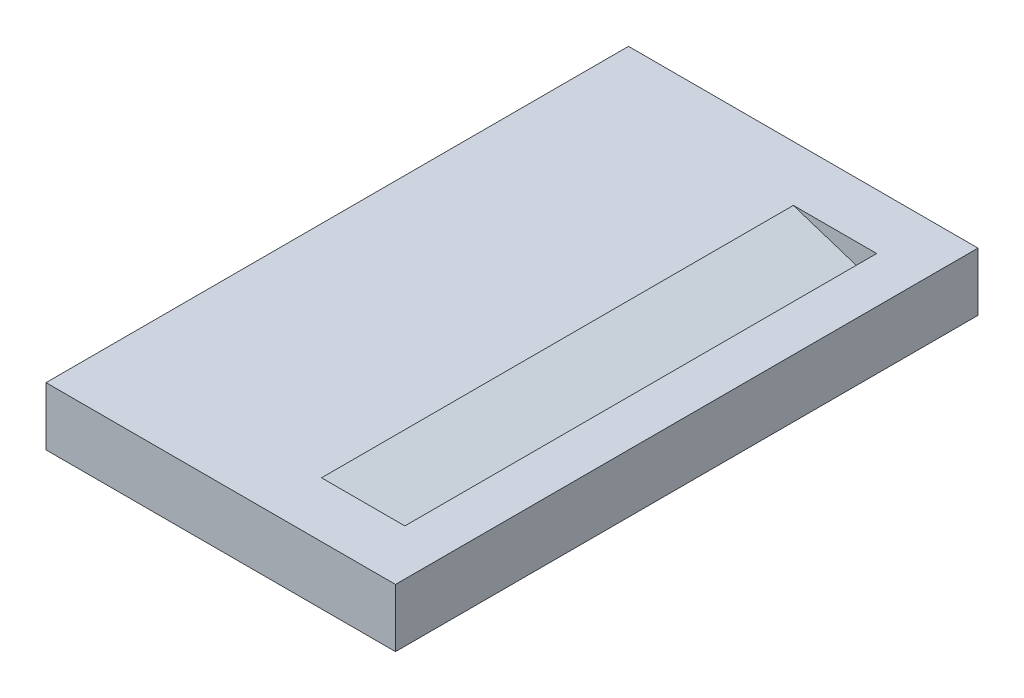
ISO-10303-21;
HEADER;
FILE_DESCRIPTION(('STEP AP214'),'2;1');
FILE_NAME('part.step','',(''),(''),'','','');
FILE_SCHEMA(('AUTOMOTIVE_DESIGN { 1 0 10303 214 1 1 1 1 }'));
ENDSEC;
DATA;
#1=APPLICATION_CONTEXT('core data for automotive mechanical design processes');
#2=APPLICATION_PROTOCOL_DEFINITION('international standard','automotive_design',2000,#1);
#3=PRODUCT_CONTEXT('',#1,'mechanical');
#4=PRODUCT('Part','Part','',(#3));
#5=PRODUCT_RELATED_PRODUCT_CATEGORY('part','',(#4));
#6=PRODUCT_DEFINITION_FORMATION('','',#4);
#7=PRODUCT_DEFINITION_CONTEXT('part definition',#1,'design');
#8=PRODUCT_DEFINITION('design','',#6,#7);
#9=PRODUCT_DEFINITION_SHAPE('','',#8);
#10=(LENGTH_UNIT() NAMED_UNIT(*) SI_UNIT(.MILLI.,.METRE.));
#11=(NAMED_UNIT(*) PLANE_ANGLE_UNIT() SI_UNIT($,.RADIAN.));
#12=(NAMED_UNIT(*) SI_UNIT($,.STERADIAN.) SOLID_ANGLE_UNIT());
#13=UNCERTAINTY_MEASURE_WITH_UNIT(LENGTH_MEASURE(1.E-05),#10,'distance_accuracy_value','');
#14=(GEOMETRIC_REPRESENTATION_CONTEXT(3) GLOBAL_UNCERTAINTY_ASSIGNED_CONTEXT((#13)) GLOBAL_UNIT_ASSIGNED_CONTEXT((#10,
#11,#12)) REPRESENTATION_CONTEXT('',''));
#15=CARTESIAN_POINT('',(0.,0.,0.));
#16=DIRECTION('',(0.,0.,1.));
#17=DIRECTION('',(1.,0.,0.));
#18=AXIS2_PLACEMENT_3D('',#15,#16,#17);
#19=CARTESIAN_POINT('',(44.775,5.,25.));
#20=DIRECTION('',(-1.,0.,0.));
#21=DIRECTION('',(0.,0.,1.));
#22=AXIS2_PLACEMENT_3D('',#19,#20,#21);
#23=PLANE('',#22);
#24=DIRECTION('',(0.,0.,-1.));
#25=VECTOR('',#24,1.);
#26=CARTESIAN_POINT('',(44.775,0.,25.));
#27=LINE('',#26,#25);
#28=CARTESIAN_POINT('',(44.775,0.,25.));
#29=VERTEX_POINT('',#28);
#30=CARTESIAN_POINT('',(44.775,0.,-25.));
#31=VERTEX_POINT('',#30);
#32=EDGE_CURVE('E119',#29,#31,#27,.T.);
#33=ORIENTED_EDGE('',*,*,#32,.T.);
#34=DIRECTION('',(0.,-1.,0.));
#35=VECTOR('',#34,1.);
#36=CARTESIAN_POINT('',(44.775,5.,-25.));
#37=LINE('',#36,#35);
#38=CARTESIAN_POINT('',(44.775,5.,-25.));
#39=VERTEX_POINT('',#38);
#40=EDGE_CURVE('E127',#39,#31,#37,.T.);
#41=ORIENTED_EDGE('',*,*,#40,.F.);
#42=DIRECTION('',(0.,0.,-1.));
#43=VECTOR('',#42,1.);
#44=CARTESIAN_POINT('',(44.775,5.,25.));
#45=LINE('',#44,#43);
#46=CARTESIAN_POINT('',(44.775,5.,25.));
#47=VERTEX_POINT('',#46);
#48=EDGE_CURVE('E109',#47,#39,#45,.T.);
#49=ORIENTED_EDGE('',*,*,#48,.F.);
#50=DIRECTION('',(0.,-1.,0.));
#51=VECTOR('',#50,1.);
#52=CARTESIAN_POINT('',(44.775,5.,25.));
#53=LINE('',#52,#51);
#54=EDGE_CURVE('E113',#47,#29,#53,.T.);
#55=ORIENTED_EDGE('',*,*,#54,.T.);
#56=EDGE_LOOP('',(#33,#41,#49,#55));
#57=FACE_BOUND('',#56,.T.);
#58=ADVANCED_FACE('F32',(#57),#23,.F.);
#59=CARTESIAN_POINT('',(-44.775,5.,-25.));
#60=DIRECTION('',(0.,0.,1.));
#61=DIRECTION('',(1.,0.,0.));
#62=AXIS2_PLACEMENT_3D('',#59,#60,#61);
#63=PLANE('',#62);
#64=DIRECTION('',(-1.,0.,0.));
#65=VECTOR('',#64,1.);
#66=CARTESIAN_POINT('',(-44.775,0.,-25.));
#67=LINE('',#66,#65);
#68=CARTESIAN_POINT('',(14.775,0.,-25.));
#69=VERTEX_POINT('',#68);
#70=EDGE_CURVE('E105',#31,#69,#67,.T.);
#71=ORIENTED_EDGE('',*,*,#70,.T.);
#72=DIRECTION('',(0.,1.,0.));
#73=VECTOR('',#72,1.);
#74=CARTESIAN_POINT('',(14.775,0.,-25.));
#75=LINE('',#74,#73);
#76=CARTESIAN_POINT('',(14.775,5.,-25.));
#77=VERTEX_POINT('',#76);
#78=EDGE_CURVE('E46',#69,#77,#75,.T.);
#79=ORIENTED_EDGE('',*,*,#78,.T.);
#80=DIRECTION('',(-1.,0.,0.));
#81=VECTOR('',#80,1.);
#82=CARTESIAN_POINT('',(-44.775,5.,-25.));
#83=LINE('',#82,#81);
#84=EDGE_CURVE('E103',#39,#77,#83,.T.);
#85=ORIENTED_EDGE('',*,*,#84,.F.);
#86=ORIENTED_EDGE('',*,*,#40,.T.);
#87=EDGE_LOOP('',(#71,#79,#85,#86));
#88=FACE_BOUND('',#87,.T.);
#89=ADVANCED_FACE('F101',(#88),#63,.F.);
#90=CARTESIAN_POINT('',(-44.775,5.,25.));
#91=DIRECTION('',(0.,0.,-1.));
#92=DIRECTION('',(-1.,0.,0.));
#93=AXIS2_PLACEMENT_3D('',#90,#91,#92);
#94=PLANE('',#93);
#95=DIRECTION('',(1.,0.,0.));
#96=VECTOR('',#95,1.);
#97=CARTESIAN_POINT('',(-44.775,5.,25.));
#98=LINE('',#97,#96);
#99=CARTESIAN_POINT('',(14.775,5.,25.));
#100=VERTEX_POINT('',#99);
#101=EDGE_CURVE('E111',#100,#47,#98,.T.);
#102=ORIENTED_EDGE('',*,*,#101,.F.);
#103=DIRECTION('',(0.,1.,0.));
#104=VECTOR('',#103,1.);
#105=CARTESIAN_POINT('',(14.775,0.,25.));
#106=LINE('',#105,#104);
#107=CARTESIAN_POINT('',(14.775,0.,25.));
#108=VERTEX_POINT('',#107);
#109=EDGE_CURVE('E92',#108,#100,#106,.T.);
#110=ORIENTED_EDGE('',*,*,#109,.F.);
#111=DIRECTION('',(1.,0.,0.));
#112=VECTOR('',#111,1.);
#113=CARTESIAN_POINT('',(-44.775,0.,25.));
#114=LINE('',#113,#112);
#115=EDGE_CURVE('E115',#108,#29,#114,.T.);
#116=ORIENTED_EDGE('',*,*,#115,.T.);
#117=ORIENTED_EDGE('',*,*,#54,.F.);
#118=EDGE_LOOP('',(#102,#110,#116,#117));
#119=FACE_BOUND('',#118,.T.);
#120=ADVANCED_FACE('F156',(#119),#94,.F.);
#121=CARTESIAN_POINT('',(0.,5.,0.));
#122=DIRECTION('',(0.,-1.,0.));
#123=DIRECTION('',(0.,0.,-1.));
#124=AXIS2_PLACEMENT_3D('',#121,#122,#123);
#125=PLANE('',#124);
#126=DIRECTION('',(1.,0.,0.));
#127=VECTOR('',#126,1.);
#128=CARTESIAN_POINT('',(0.,5.,-20.25));
#129=LINE('',#128,#127);
#130=CARTESIAN_POINT('',(33.6752868371757,5.,-20.25));
#131=VERTEX_POINT('',#130);
#132=CARTESIAN_POINT('',(40.828910571105,5.,-20.25));
#133=VERTEX_POINT('',#132);
#134=EDGE_CURVE('E132',#131,#133,#129,.T.);
#135=ORIENTED_EDGE('',*,*,#134,.T.);
#136=DIRECTION('',(0.,0.,1.));
#137=VECTOR('',#136,1.);
#138=CARTESIAN_POINT('',(40.828910571105,5.,0.));
#139=LINE('',#138,#137);
#140=CARTESIAN_POINT('',(40.828910571105,5.,20.25));
#141=VERTEX_POINT('',#140);
#142=EDGE_CURVE('E11',#133,#141,#139,.T.);
#143=ORIENTED_EDGE('',*,*,#142,.T.);
#144=DIRECTION('',(-1.,0.,0.));
#145=VECTOR('',#144,1.);
#146=CARTESIAN_POINT('',(0.,5.,20.25));
#147=LINE('',#146,#145);
#148=CARTESIAN_POINT('',(33.6752868371757,4.99999999999999,20.25));
#149=VERTEX_POINT('',#148);
#150=EDGE_CURVE('E39',#141,#149,#147,.T.);
#151=ORIENTED_EDGE('',*,*,#150,.T.);
#152=DIRECTION('',(0.,0.,-1.));
#153=VECTOR('',#152,1.);
#154=CARTESIAN_POINT('',(33.6752868371757,5.,0.));
#155=LINE('',#154,#153);
#156=EDGE_CURVE('E129',#149,#131,#155,.T.);
#157=ORIENTED_EDGE('',*,*,#156,.T.);
#158=EDGE_LOOP('',(#135,#143,#151,#157));
#159=FACE_BOUND('',#158,.T.);
#160=ORIENTED_EDGE('',*,*,#84,.T.);
#161=DIRECTION('',(0.,0.,1.));
#162=VECTOR('',#161,1.);
#163=CARTESIAN_POINT('',(14.775,5.,-25.));
#164=LINE('',#163,#162);
#165=EDGE_CURVE('E89',#77,#100,#164,.T.);
#166=ORIENTED_EDGE('',*,*,#165,.T.);
#167=ORIENTED_EDGE('',*,*,#101,.T.);
#168=ORIENTED_EDGE('',*,*,#48,.T.);
#169=EDGE_LOOP('',(#160,#166,#167,#168));
#170=FACE_BOUND('',#169,.T.);
#171=ADVANCED_FACE('F107',(#159,#170),#125,.F.);
#172=CARTESIAN_POINT('',(0.,0.,0.));
#173=DIRECTION('',(0.,-1.,0.));
#174=DIRECTION('',(0.,0.,-1.));
#175=AXIS2_PLACEMENT_3D('',#172,#173,#174);
#176=PLANE('',#175);
#177=DIRECTION('',(0.,0.,1.));
#178=VECTOR('',#177,1.);
#179=CARTESIAN_POINT('',(14.775,0.,-25.));
#180=LINE('',#179,#178);
#181=EDGE_CURVE('E97',#69,#108,#180,.T.);
#182=ORIENTED_EDGE('',*,*,#181,.F.);
#183=ORIENTED_EDGE('',*,*,#70,.F.);
#184=ORIENTED_EDGE('',*,*,#32,.F.);
#185=ORIENTED_EDGE('',*,*,#115,.F.);
#186=EDGE_LOOP('',(#182,#183,#184,#185));
#187=FACE_BOUND('',#186,.T.);
#188=ADVANCED_FACE('F159',(#187),#176,.T.);
#189=CARTESIAN_POINT('',(40.1458002901968,2.89760273437346,20.25));
#190=DIRECTION('',(0.,0.,1.));
#191=DIRECTION('',(1.,0.,0.));
#192=AXIS2_PLACEMENT_3D('',#189,#190,#191);
#193=PLANE('',#192);
#194=DIRECTION('',(0.309016994374948,0.951056516295153,0.));
#195=VECTOR('',#194,1.);
#196=CARTESIAN_POINT('',(40.1458002901968,2.89760273437346,20.25));
#197=LINE('',#196,#195);
#198=CARTESIAN_POINT('',(40.1458002901968,2.89760273437346,20.25));
#199=VERTEX_POINT('',#198);
#200=EDGE_CURVE('E141',#199,#141,#197,.T.);
#201=ORIENTED_EDGE('',*,*,#200,.F.);
#202=DIRECTION('',(0.951056516295153,-0.309016994374948,0.));
#203=VECTOR('',#202,1.);
#204=CARTESIAN_POINT('',(40.1458002901968,2.89760273437346,20.25));
#205=LINE('',#204,#203);
#206=EDGE_CURVE('E96',#149,#199,#205,.T.);
#207=ORIENTED_EDGE('',*,*,#206,.F.);
#208=ORIENTED_EDGE('',*,*,#150,.F.);
#209=EDGE_LOOP('',(#201,#207,#208));
#210=FACE_BOUND('',#209,.T.);
#211=ADVANCED_FACE('F140',(#210),#193,.F.);
#212=CARTESIAN_POINT('',(40.1458002901968,2.89760273437346,-20.25));
#213=DIRECTION('',(0.,0.,-1.));
#214=DIRECTION('',(-1.,0.,0.));
#215=AXIS2_PLACEMENT_3D('',#212,#213,#214);
#216=PLANE('',#215);
#217=DIRECTION('',(-0.951056516295153,0.309016994374948,0.));
#218=VECTOR('',#217,1.);
#219=CARTESIAN_POINT('',(40.1458002901968,2.89760273437346,-20.25));
#220=LINE('',#219,#218);
#221=CARTESIAN_POINT('',(40.1458002901968,2.89760273437346,-20.25));
#222=VERTEX_POINT('',#221);
#223=EDGE_CURVE('E54',#222,#131,#220,.T.);
#224=ORIENTED_EDGE('',*,*,#223,.F.);
#225=DIRECTION('',(0.309016994374948,0.951056516295153,0.));
#226=VECTOR('',#225,1.);
#227=CARTESIAN_POINT('',(40.1458002901968,2.89760273437346,-20.25));
#228=LINE('',#227,#226);
#229=EDGE_CURVE('E122',#222,#133,#228,.T.);
#230=ORIENTED_EDGE('',*,*,#229,.T.);
#231=ORIENTED_EDGE('',*,*,#134,.F.);
#232=EDGE_LOOP('',(#224,#230,#231));
#233=FACE_BOUND('',#232,.T.);
#234=ADVANCED_FACE('F176',(#233),#216,.F.);
#235=CARTESIAN_POINT('',(40.1458002901968,2.89760273437346,20.25));
#236=DIRECTION('',(0.951056516295153,-0.309016994374948,0.));
#237=DIRECTION('',(0.309016994374948,0.951056516295153,0.));
#238=AXIS2_PLACEMENT_3D('',#235,#236,#237);
#239=PLANE('',#238);
#240=ORIENTED_EDGE('',*,*,#229,.F.);
#241=DIRECTION('',(0.,0.,-1.));
#242=VECTOR('',#241,1.);
#243=CARTESIAN_POINT('',(40.1458002901968,2.89760273437346,20.25));
#244=LINE('',#243,#242);
#245=EDGE_CURVE('E146',#199,#222,#244,.T.);
#246=ORIENTED_EDGE('',*,*,#245,.F.);
#247=ORIENTED_EDGE('',*,*,#200,.T.);
#248=ORIENTED_EDGE('',*,*,#142,.F.);
#249=EDGE_LOOP('',(#240,#246,#247,#248));
#250=FACE_BOUND('',#249,.T.);
#251=ADVANCED_FACE('F144',(#250),#239,.F.);
#252=CARTESIAN_POINT('',(4.685166878456,14.4194609707428,0.));
#253=DIRECTION('',(-0.309016994374948,-0.951056516295153,0.));
#254=DIRECTION('',(0.951056516295153,-0.309016994374948,0.));
#255=AXIS2_PLACEMENT_3D('',#252,#253,#254);
#256=PLANE('',#255);
#257=ORIENTED_EDGE('',*,*,#206,.T.);
#258=ORIENTED_EDGE('',*,*,#245,.T.);
#259=ORIENTED_EDGE('',*,*,#223,.T.);
#260=ORIENTED_EDGE('',*,*,#156,.F.);
#261=EDGE_LOOP('',(#257,#258,#259,#260));
#262=FACE_BOUND('',#261,.T.);
#263=ADVANCED_FACE('F179',(#262),#256,.F.);
#264=CARTESIAN_POINT('',(14.775,0.,-25.));
#265=DIRECTION('',(1.,0.,0.));
#266=DIRECTION('',(0.,0.,-1.));
#267=AXIS2_PLACEMENT_3D('',#264,#265,#266);
#268=PLANE('',#267);
#269=ORIENTED_EDGE('',*,*,#109,.T.);
#270=ORIENTED_EDGE('',*,*,#165,.F.);
#271=ORIENTED_EDGE('',*,*,#78,.F.);
#272=ORIENTED_EDGE('',*,*,#181,.T.);
#273=EDGE_LOOP('',(#269,#270,#271,#272));
#274=FACE_BOUND('',#273,.T.);
#275=ADVANCED_FACE('F90',(#274),#268,.F.);
#276=CLOSED_SHELL('',(#58,#89,#120,#171,#188,#211,#234,#251,#263,#275));
#277=MANIFOLD_SOLID_BREP('B2',#276);
#278=ADVANCED_BREP_SHAPE_REPRESENTATION('',(#18,#277),#14);
#279=SHAPE_DEFINITION_REPRESENTATION(#9,#278);
ENDSEC;
END-ISO-10303-21;
